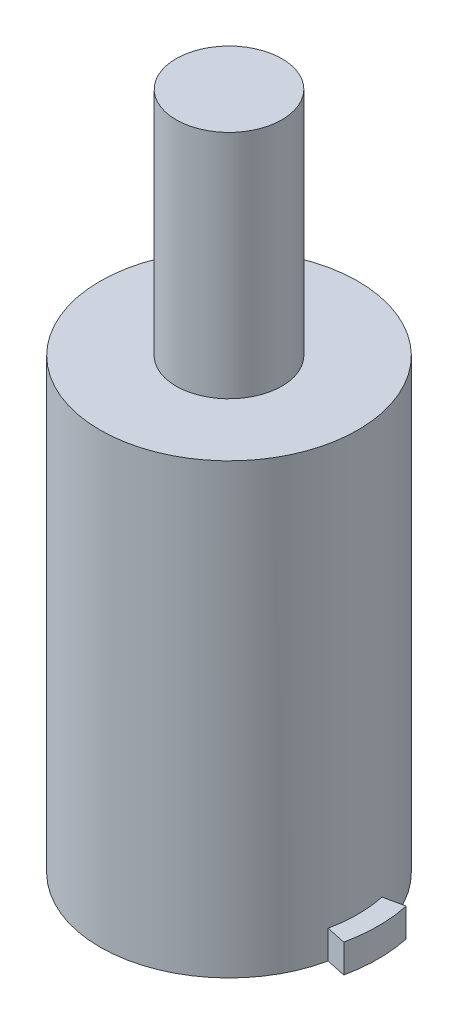
ISO-10303-21;
HEADER;
FILE_DESCRIPTION(('STEP AP214'),'2;1');
FILE_NAME('part.step','',(''),(''),'','','');
FILE_SCHEMA(('AUTOMOTIVE_DESIGN { 1 0 10303 214 1 1 1 1 }'));
ENDSEC;
DATA;
#1=APPLICATION_CONTEXT('core data for automotive mechanical design processes');
#2=APPLICATION_PROTOCOL_DEFINITION('international standard','automotive_design',2000,#1);
#3=PRODUCT_CONTEXT('',#1,'mechanical');
#4=PRODUCT('Part','Part','',(#3));
#5=PRODUCT_RELATED_PRODUCT_CATEGORY('part','',(#4));
#6=PRODUCT_DEFINITION_FORMATION('','',#4);
#7=PRODUCT_DEFINITION_CONTEXT('part definition',#1,'design');
#8=PRODUCT_DEFINITION('design','',#6,#7);
#9=PRODUCT_DEFINITION_SHAPE('','',#8);
#10=(LENGTH_UNIT() NAMED_UNIT(*) SI_UNIT(.MILLI.,.METRE.));
#11=(NAMED_UNIT(*) PLANE_ANGLE_UNIT() SI_UNIT($,.RADIAN.));
#12=(NAMED_UNIT(*) SI_UNIT($,.STERADIAN.) SOLID_ANGLE_UNIT());
#13=UNCERTAINTY_MEASURE_WITH_UNIT(LENGTH_MEASURE(1.E-05),#10,'distance_accuracy_value','');
#14=(GEOMETRIC_REPRESENTATION_CONTEXT(3) GLOBAL_UNCERTAINTY_ASSIGNED_CONTEXT((#13)) GLOBAL_UNIT_ASSIGNED_CONTEXT((#10,
#11,#12)) REPRESENTATION_CONTEXT('',''));
#15=CARTESIAN_POINT('',(0.,0.,0.));
#16=DIRECTION('',(0.,0.,1.));
#17=DIRECTION('',(1.,0.,0.));
#18=AXIS2_PLACEMENT_3D('',#15,#16,#17);
#19=CARTESIAN_POINT('',(0.,16.5,0.));
#20=DIRECTION('',(0.,1.,0.));
#21=DIRECTION('',(0.,0.,1.));
#22=AXIS2_PLACEMENT_3D('',#19,#20,#21);
#23=PLANE('',#22);
#24=CARTESIAN_POINT('',(0.,16.5,0.));
#25=DIRECTION('',(0.,1.,0.));
#26=DIRECTION('',(0.,0.,1.));
#27=AXIS2_PLACEMENT_3D('',#24,#25,#26);
#28=CIRCLE('',#27,4.75);
#29=CARTESIAN_POINT('',(0.,16.5,4.75));
#30=VERTEX_POINT('',#29);
#31=EDGE_CURVE('E11',#30,#30,#28,.T.);
#32=ORIENTED_EDGE('',*,*,#31,.T.);
#33=EDGE_LOOP('',(#32));
#34=FACE_BOUND('',#33,.T.);
#35=CARTESIAN_POINT('',(0.,16.5,0.));
#36=DIRECTION('',(0.,1.,0.));
#37=DIRECTION('',(0.,0.,1.));
#38=AXIS2_PLACEMENT_3D('',#35,#36,#37);
#39=CIRCLE('',#38,1.95);
#40=CARTESIAN_POINT('',(0.,16.5,1.95));
#41=VERTEX_POINT('',#40);
#42=EDGE_CURVE('E152',#41,#41,#39,.T.);
#43=ORIENTED_EDGE('',*,*,#42,.F.);
#44=EDGE_LOOP('',(#43));
#45=FACE_BOUND('',#44,.T.);
#46=ADVANCED_FACE('F30',(#34,#45),#23,.T.);
#47=CARTESIAN_POINT('',(0.,16.5,0.));
#48=DIRECTION('',(0.,-1.,0.));
#49=DIRECTION('',(0.,0.,-1.));
#50=AXIS2_PLACEMENT_3D('',#47,#48,#49);
#51=CYLINDRICAL_SURFACE('',#50,4.75);
#52=CARTESIAN_POINT('',(0.,0.,0.));
#53=DIRECTION('',(0.,1.,0.));
#54=DIRECTION('',(0.,0.,1.));
#55=AXIS2_PLACEMENT_3D('',#52,#53,#54);
#56=CIRCLE('',#55,4.75);
#57=CARTESIAN_POINT('',(-4.64500698342134,0.,0.993181818181817));
#58=VERTEX_POINT('',#57);
#59=CARTESIAN_POINT('',(4.64500698342134,0.,0.993181818181817));
#60=VERTEX_POINT('',#59);
#61=EDGE_CURVE('E34',#58,#60,#56,.T.);
#62=ORIENTED_EDGE('',*,*,#61,.T.);
#63=DIRECTION('',(0.,-1.,0.));
#64=VECTOR('',#63,1.);
#65=CARTESIAN_POINT('',(4.64500698342134,1.05,0.993181818181817));
#66=LINE('',#65,#64);
#67=CARTESIAN_POINT('',(4.64500698342134,1.05,0.993181818181817));
#68=VERTEX_POINT('',#67);
#69=EDGE_CURVE('E50',#68,#60,#66,.T.);
#70=ORIENTED_EDGE('',*,*,#69,.F.);
#71=CARTESIAN_POINT('',(0.,1.05,0.));
#72=DIRECTION('',(0.,1.,0.));
#73=DIRECTION('',(0.,0.,1.));
#74=AXIS2_PLACEMENT_3D('',#71,#72,#73);
#75=CIRCLE('',#74,4.75);
#76=CARTESIAN_POINT('',(4.64500698342134,1.05,-0.993181818181818));
#77=VERTEX_POINT('',#76);
#78=EDGE_CURVE('E45',#68,#77,#75,.T.);
#79=ORIENTED_EDGE('',*,*,#78,.T.);
#80=DIRECTION('',(0.,-1.,0.));
#81=VECTOR('',#80,1.);
#82=CARTESIAN_POINT('',(4.64500698342134,1.05,-0.993181818181818));
#83=LINE('',#82,#81);
#84=CARTESIAN_POINT('',(4.64500698342134,0.,-0.993181818181818));
#85=VERTEX_POINT('',#84);
#86=EDGE_CURVE('E106',#77,#85,#83,.T.);
#87=ORIENTED_EDGE('',*,*,#86,.T.);
#88=CARTESIAN_POINT('',(-4.64500698342134,0.,-0.993181818181818));
#89=VERTEX_POINT('',#88);
#90=EDGE_CURVE('E163',#85,#89,#56,.T.);
#91=ORIENTED_EDGE('',*,*,#90,.T.);
#92=DIRECTION('',(0.,-1.,0.));
#93=VECTOR('',#92,1.);
#94=CARTESIAN_POINT('',(-4.64500698342134,1.05,-0.993181818181819));
#95=LINE('',#94,#93);
#96=CARTESIAN_POINT('',(-4.64500698342134,1.05,-0.993181818181819));
#97=VERTEX_POINT('',#96);
#98=EDGE_CURVE('E156',#97,#89,#95,.T.);
#99=ORIENTED_EDGE('',*,*,#98,.F.);
#100=CARTESIAN_POINT('',(0.,1.05,0.));
#101=DIRECTION('',(0.,1.,0.));
#102=DIRECTION('',(0.,0.,-1.));
#103=AXIS2_PLACEMENT_3D('',#100,#101,#102);
#104=CIRCLE('',#103,4.75);
#105=CARTESIAN_POINT('',(-4.64500698342134,1.05,0.993181818181817));
#106=VERTEX_POINT('',#105);
#107=EDGE_CURVE('E137',#97,#106,#104,.T.);
#108=ORIENTED_EDGE('',*,*,#107,.T.);
#109=DIRECTION('',(0.,-1.,0.));
#110=VECTOR('',#109,1.);
#111=CARTESIAN_POINT('',(-4.64500698342134,1.05,0.993181818181817));
#112=LINE('',#111,#110);
#113=EDGE_CURVE('E153',#106,#58,#112,.T.);
#114=ORIENTED_EDGE('',*,*,#113,.T.);
#115=EDGE_LOOP('',(#62,#70,#79,#87,#91,#99,#108,#114));
#116=FACE_BOUND('',#115,.T.);
#117=ORIENTED_EDGE('',*,*,#31,.F.);
#118=EDGE_LOOP('',(#117));
#119=FACE_BOUND('',#118,.T.);
#120=ADVANCED_FACE('F32',(#116,#119),#51,.T.);
#121=CARTESIAN_POINT('',(0.,0.,0.));
#122=DIRECTION('',(0.,1.,0.));
#123=DIRECTION('',(0.,0.,1.));
#124=AXIS2_PLACEMENT_3D('',#121,#122,#123);
#125=PLANE('',#124);
#126=ORIENTED_EDGE('',*,*,#61,.F.);
#127=DIRECTION('',(-0.977896207036072,0.,0.209090909090909));
#128=VECTOR('',#127,1.);
#129=CARTESIAN_POINT('',(-5.3784291386984,0.,1.15));
#130=LINE('',#129,#128);
#131=CARTESIAN_POINT('',(-5.3784291386984,0.,1.15));
#132=VERTEX_POINT('',#131);
#133=EDGE_CURVE('E134',#58,#132,#130,.T.);
#134=ORIENTED_EDGE('',*,*,#133,.T.);
#135=CARTESIAN_POINT('',(0.,0.,0.));
#136=DIRECTION('',(0.,-1.,0.));
#137=DIRECTION('',(0.,0.,-1.));
#138=AXIS2_PLACEMENT_3D('',#135,#136,#137);
#139=CIRCLE('',#138,5.5);
#140=CARTESIAN_POINT('',(-5.3784291386984,0.,-1.15));
#141=VERTEX_POINT('',#140);
#142=EDGE_CURVE('E127',#132,#141,#139,.T.);
#143=ORIENTED_EDGE('',*,*,#142,.T.);
#144=DIRECTION('',(0.977896207036072,0.,0.209090909090909));
#145=VECTOR('',#144,1.);
#146=CARTESIAN_POINT('',(-4.64500698342134,0.,-0.993181818181818));
#147=LINE('',#146,#145);
#148=EDGE_CURVE('E145',#141,#89,#147,.T.);
#149=ORIENTED_EDGE('',*,*,#148,.T.);
#150=ORIENTED_EDGE('',*,*,#90,.F.);
#151=DIRECTION('',(0.977896207036072,0.,-0.209090909090909));
#152=VECTOR('',#151,1.);
#153=CARTESIAN_POINT('',(4.64500698342134,0.,-0.993181818181818));
#154=LINE('',#153,#152);
#155=CARTESIAN_POINT('',(5.3784291386984,0.,-1.15));
#156=VERTEX_POINT('',#155);
#157=EDGE_CURVE('E121',#85,#156,#154,.T.);
#158=ORIENTED_EDGE('',*,*,#157,.T.);
#159=CARTESIAN_POINT('',(0.,0.,0.));
#160=DIRECTION('',(0.,-1.,0.));
#161=DIRECTION('',(0.,0.,1.));
#162=AXIS2_PLACEMENT_3D('',#159,#160,#161);
#163=CIRCLE('',#162,5.5);
#164=CARTESIAN_POINT('',(5.3784291386984,0.,1.15));
#165=VERTEX_POINT('',#164);
#166=EDGE_CURVE('E100',#156,#165,#163,.T.);
#167=ORIENTED_EDGE('',*,*,#166,.T.);
#168=DIRECTION('',(-0.977896207036072,0.,-0.209090909090909));
#169=VECTOR('',#168,1.);
#170=CARTESIAN_POINT('',(5.3784291386984,0.,1.15));
#171=LINE('',#170,#169);
#172=EDGE_CURVE('E117',#165,#60,#171,.T.);
#173=ORIENTED_EDGE('',*,*,#172,.T.);
#174=EDGE_LOOP('',(#126,#134,#143,#149,#150,#158,#167,#173));
#175=FACE_BOUND('',#174,.T.);
#176=ADVANCED_FACE('F175',(#175),#125,.F.);
#177=CARTESIAN_POINT('',(0.,25.,0.));
#178=DIRECTION('',(0.,-1.,0.));
#179=DIRECTION('',(0.,0.,-1.));
#180=AXIS2_PLACEMENT_3D('',#177,#178,#179);
#181=CYLINDRICAL_SURFACE('',#180,1.95);
#182=CARTESIAN_POINT('',(0.,25.,0.));
#183=DIRECTION('',(0.,1.,0.));
#184=DIRECTION('',(0.,0.,1.));
#185=AXIS2_PLACEMENT_3D('',#182,#183,#184);
#186=CIRCLE('',#185,1.95);
#187=CARTESIAN_POINT('',(0.,25.,1.95));
#188=VERTEX_POINT('',#187);
#189=EDGE_CURVE('E160',#188,#188,#186,.T.);
#190=ORIENTED_EDGE('',*,*,#189,.F.);
#191=EDGE_LOOP('',(#190));
#192=FACE_BOUND('',#191,.T.);
#193=ORIENTED_EDGE('',*,*,#42,.T.);
#194=EDGE_LOOP('',(#193));
#195=FACE_BOUND('',#194,.T.);
#196=ADVANCED_FACE('F167',(#192,#195),#181,.T.);
#197=CARTESIAN_POINT('',(0.,25.,0.));
#198=DIRECTION('',(0.,1.,0.));
#199=DIRECTION('',(0.,0.,1.));
#200=AXIS2_PLACEMENT_3D('',#197,#198,#199);
#201=PLANE('',#200);
#202=ORIENTED_EDGE('',*,*,#189,.T.);
#203=EDGE_LOOP('',(#202));
#204=FACE_BOUND('',#203,.T.);
#205=ADVANCED_FACE('F183',(#204),#201,.T.);
#206=CARTESIAN_POINT('',(0.,1.05,0.));
#207=DIRECTION('',(0.,-1.,0.));
#208=DIRECTION('',(0.,0.,-1.));
#209=AXIS2_PLACEMENT_3D('',#206,#207,#208);
#210=CYLINDRICAL_SURFACE('',#209,5.5);
#211=ORIENTED_EDGE('',*,*,#142,.F.);
#212=DIRECTION('',(0.,-1.,0.));
#213=VECTOR('',#212,1.);
#214=CARTESIAN_POINT('',(-5.3784291386984,1.05,1.15));
#215=LINE('',#214,#213);
#216=CARTESIAN_POINT('',(-5.3784291386984,1.05,1.15));
#217=VERTEX_POINT('',#216);
#218=EDGE_CURVE('E150',#217,#132,#215,.T.);
#219=ORIENTED_EDGE('',*,*,#218,.F.);
#220=CARTESIAN_POINT('',(0.,1.05,0.));
#221=DIRECTION('',(0.,-1.,0.));
#222=DIRECTION('',(0.,0.,-1.));
#223=AXIS2_PLACEMENT_3D('',#220,#221,#222);
#224=CIRCLE('',#223,5.5);
#225=CARTESIAN_POINT('',(-5.3784291386984,1.05,-1.15));
#226=VERTEX_POINT('',#225);
#227=EDGE_CURVE('E130',#217,#226,#224,.T.);
#228=ORIENTED_EDGE('',*,*,#227,.T.);
#229=DIRECTION('',(0.,-1.,0.));
#230=VECTOR('',#229,1.);
#231=CARTESIAN_POINT('',(-5.3784291386984,1.05,-1.15));
#232=LINE('',#231,#230);
#233=EDGE_CURVE('E142',#226,#141,#232,.T.);
#234=ORIENTED_EDGE('',*,*,#233,.T.);
#235=EDGE_LOOP('',(#211,#219,#228,#234));
#236=FACE_BOUND('',#235,.T.);
#237=ADVANCED_FACE('F196',(#236),#210,.T.);
#238=CARTESIAN_POINT('',(-5.3784291386984,1.05,1.15));
#239=DIRECTION('',(0.209090909090909,0.,0.977896207036073));
#240=DIRECTION('',(0.977896207036073,0.,-0.209090909090909));
#241=AXIS2_PLACEMENT_3D('',#238,#239,#240);
#242=PLANE('',#241);
#243=ORIENTED_EDGE('',*,*,#133,.F.);
#244=ORIENTED_EDGE('',*,*,#113,.F.);
#245=DIRECTION('',(-0.977896207036072,0.,0.209090909090909));
#246=VECTOR('',#245,1.);
#247=CARTESIAN_POINT('',(-5.3784291386984,1.05,1.15));
#248=LINE('',#247,#246);
#249=EDGE_CURVE('E139',#106,#217,#248,.T.);
#250=ORIENTED_EDGE('',*,*,#249,.T.);
#251=ORIENTED_EDGE('',*,*,#218,.T.);
#252=EDGE_LOOP('',(#243,#244,#250,#251));
#253=FACE_BOUND('',#252,.T.);
#254=ADVANCED_FACE('F192',(#253),#242,.T.);
#255=CARTESIAN_POINT('',(-4.64500698342134,1.05,-0.993181818181818));
#256=DIRECTION('',(0.209090909090909,0.,-0.977896207036073));
#257=DIRECTION('',(-0.977896207036073,0.,-0.209090909090909));
#258=AXIS2_PLACEMENT_3D('',#255,#256,#257);
#259=PLANE('',#258);
#260=ORIENTED_EDGE('',*,*,#148,.F.);
#261=ORIENTED_EDGE('',*,*,#233,.F.);
#262=DIRECTION('',(0.977896207036072,0.,0.209090909090909));
#263=VECTOR('',#262,1.);
#264=CARTESIAN_POINT('',(-4.64500698342134,1.05,-0.993181818181818));
#265=LINE('',#264,#263);
#266=EDGE_CURVE('E133',#226,#97,#265,.T.);
#267=ORIENTED_EDGE('',*,*,#266,.T.);
#268=ORIENTED_EDGE('',*,*,#98,.T.);
#269=EDGE_LOOP('',(#260,#261,#267,#268));
#270=FACE_BOUND('',#269,.T.);
#271=ADVANCED_FACE('F199',(#270),#259,.T.);
#272=CARTESIAN_POINT('',(0.,1.05,0.));
#273=DIRECTION('',(0.,-1.,0.));
#274=DIRECTION('',(0.,0.,-1.));
#275=AXIS2_PLACEMENT_3D('',#272,#273,#274);
#276=PLANE('',#275);
#277=ORIENTED_EDGE('',*,*,#227,.F.);
#278=ORIENTED_EDGE('',*,*,#249,.F.);
#279=ORIENTED_EDGE('',*,*,#107,.F.);
#280=ORIENTED_EDGE('',*,*,#266,.F.);
#281=EDGE_LOOP('',(#277,#278,#279,#280));
#282=FACE_BOUND('',#281,.T.);
#283=ADVANCED_FACE('F202',(#282),#276,.F.);
#284=CARTESIAN_POINT('',(5.3784291386984,1.05,1.15));
#285=DIRECTION('',(-0.209090909090909,0.,0.977896207036073));
#286=DIRECTION('',(0.977896207036073,0.,0.209090909090909));
#287=AXIS2_PLACEMENT_3D('',#284,#285,#286);
#288=PLANE('',#287);
#289=ORIENTED_EDGE('',*,*,#172,.F.);
#290=DIRECTION('',(0.,-1.,0.));
#291=VECTOR('',#290,1.);
#292=CARTESIAN_POINT('',(5.3784291386984,1.05,1.15));
#293=LINE('',#292,#291);
#294=CARTESIAN_POINT('',(5.3784291386984,1.05,1.15));
#295=VERTEX_POINT('',#294);
#296=EDGE_CURVE('E105',#295,#165,#293,.T.);
#297=ORIENTED_EDGE('',*,*,#296,.F.);
#298=DIRECTION('',(-0.977896207036072,0.,-0.209090909090909));
#299=VECTOR('',#298,1.);
#300=CARTESIAN_POINT('',(5.3784291386984,1.05,1.15));
#301=LINE('',#300,#299);
#302=EDGE_CURVE('E113',#295,#68,#301,.T.);
#303=ORIENTED_EDGE('',*,*,#302,.T.);
#304=ORIENTED_EDGE('',*,*,#69,.T.);
#305=EDGE_LOOP('',(#289,#297,#303,#304));
#306=FACE_BOUND('',#305,.T.);
#307=ADVANCED_FACE('F204',(#306),#288,.T.);
#308=CARTESIAN_POINT('',(0.,1.05,0.));
#309=DIRECTION('',(0.,-1.,0.));
#310=DIRECTION('',(0.,0.,-1.));
#311=AXIS2_PLACEMENT_3D('',#308,#309,#310);
#312=CYLINDRICAL_SURFACE('',#311,5.5);
#313=ORIENTED_EDGE('',*,*,#166,.F.);
#314=DIRECTION('',(0.,-1.,0.));
#315=VECTOR('',#314,1.);
#316=CARTESIAN_POINT('',(5.3784291386984,1.05,-1.15));
#317=LINE('',#316,#315);
#318=CARTESIAN_POINT('',(5.3784291386984,1.05,-1.15));
#319=VERTEX_POINT('',#318);
#320=EDGE_CURVE('E94',#319,#156,#317,.T.);
#321=ORIENTED_EDGE('',*,*,#320,.F.);
#322=CARTESIAN_POINT('',(0.,1.05,0.));
#323=DIRECTION('',(0.,-1.,0.));
#324=DIRECTION('',(0.,0.,1.));
#325=AXIS2_PLACEMENT_3D('',#322,#323,#324);
#326=CIRCLE('',#325,5.5);
#327=EDGE_CURVE('E97',#319,#295,#326,.T.);
#328=ORIENTED_EDGE('',*,*,#327,.T.);
#329=ORIENTED_EDGE('',*,*,#296,.T.);
#330=EDGE_LOOP('',(#313,#321,#328,#329));
#331=FACE_BOUND('',#330,.T.);
#332=ADVANCED_FACE('F96',(#331),#312,.T.);
#333=CARTESIAN_POINT('',(4.64500698342134,1.05,-0.993181818181818));
#334=DIRECTION('',(-0.209090909090909,0.,-0.977896207036073));
#335=DIRECTION('',(-0.977896207036073,0.,0.209090909090909));
#336=AXIS2_PLACEMENT_3D('',#333,#334,#335);
#337=PLANE('',#336);
#338=ORIENTED_EDGE('',*,*,#157,.F.);
#339=ORIENTED_EDGE('',*,*,#86,.F.);
#340=DIRECTION('',(0.977896207036072,0.,-0.209090909090909));
#341=VECTOR('',#340,1.);
#342=CARTESIAN_POINT('',(4.64500698342134,1.05,-0.993181818181818));
#343=LINE('',#342,#341);
#344=EDGE_CURVE('E111',#77,#319,#343,.T.);
#345=ORIENTED_EDGE('',*,*,#344,.T.);
#346=ORIENTED_EDGE('',*,*,#320,.T.);
#347=EDGE_LOOP('',(#338,#339,#345,#346));
#348=FACE_BOUND('',#347,.T.);
#349=ADVANCED_FACE('F115',(#348),#337,.T.);
#350=CARTESIAN_POINT('',(0.,1.05,0.));
#351=DIRECTION('',(0.,1.,0.));
#352=DIRECTION('',(0.,0.,1.));
#353=AXIS2_PLACEMENT_3D('',#350,#351,#352);
#354=PLANE('',#353);
#355=ORIENTED_EDGE('',*,*,#78,.F.);
#356=ORIENTED_EDGE('',*,*,#302,.F.);
#357=ORIENTED_EDGE('',*,*,#327,.F.);
#358=ORIENTED_EDGE('',*,*,#344,.F.);
#359=EDGE_LOOP('',(#355,#356,#357,#358));
#360=FACE_BOUND('',#359,.T.);
#361=ADVANCED_FACE('F110',(#360),#354,.T.);
#362=CLOSED_SHELL('',(#46,#120,#176,#196,#205,#237,#254,#271,#283,#307,#332,#349,#361));
#363=MANIFOLD_SOLID_BREP('B2',#362);
#364=ADVANCED_BREP_SHAPE_REPRESENTATION('',(#18,#363),#14);
#365=SHAPE_DEFINITION_REPRESENTATION(#9,#364);
ENDSEC;
END-ISO-10303-21;
